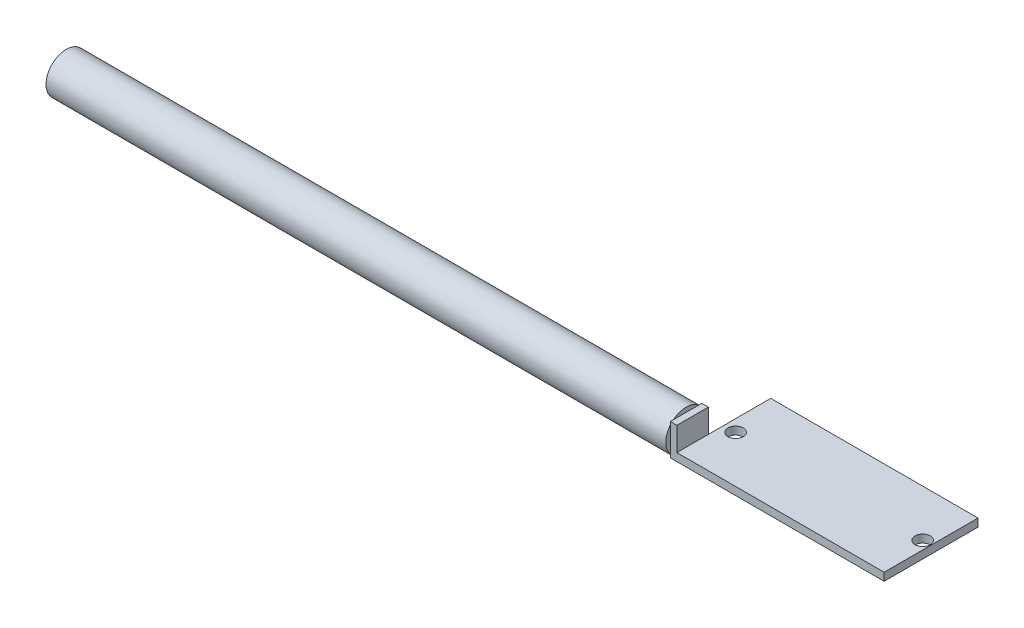
ISO-10303-21;
HEADER;
FILE_DESCRIPTION(('STEP AP214'),'2;1');
FILE_NAME('part.step','',(''),(''),'','','');
FILE_SCHEMA(('AUTOMOTIVE_DESIGN { 1 0 10303 214 1 1 1 1 }'));
ENDSEC;
DATA;
#1=APPLICATION_CONTEXT('core data for automotive mechanical design processes');
#2=APPLICATION_PROTOCOL_DEFINITION('international standard','automotive_design',2000,#1);
#3=PRODUCT_CONTEXT('',#1,'mechanical');
#4=PRODUCT('Part','Part','',(#3));
#5=PRODUCT_RELATED_PRODUCT_CATEGORY('part','',(#4));
#6=PRODUCT_DEFINITION_FORMATION('','',#4);
#7=PRODUCT_DEFINITION_CONTEXT('part definition',#1,'design');
#8=PRODUCT_DEFINITION('design','',#6,#7);
#9=PRODUCT_DEFINITION_SHAPE('','',#8);
#10=(LENGTH_UNIT() NAMED_UNIT(*) SI_UNIT(.MILLI.,.METRE.));
#11=(NAMED_UNIT(*) PLANE_ANGLE_UNIT() SI_UNIT($,.RADIAN.));
#12=(NAMED_UNIT(*) SI_UNIT($,.STERADIAN.) SOLID_ANGLE_UNIT());
#13=UNCERTAINTY_MEASURE_WITH_UNIT(LENGTH_MEASURE(1.E-05),#10,'distance_accuracy_value','');
#14=(GEOMETRIC_REPRESENTATION_CONTEXT(3) GLOBAL_UNCERTAINTY_ASSIGNED_CONTEXT((#13)) GLOBAL_UNIT_ASSIGNED_CONTEXT((#10,
#11,#12)) REPRESENTATION_CONTEXT('',''));
#15=CARTESIAN_POINT('',(0.,0.,0.));
#16=DIRECTION('',(0.,0.,1.));
#17=DIRECTION('',(1.,0.,0.));
#18=AXIS2_PLACEMENT_3D('',#15,#16,#17);
#19=CARTESIAN_POINT('',(-21.336,0.,0.));
#20=DIRECTION('',(-1.,0.,0.));
#21=DIRECTION('',(0.,0.,1.));
#22=AXIS2_PLACEMENT_3D('',#19,#20,#21);
#23=PLANE('',#22);
#24=CARTESIAN_POINT('',(-21.336,3.048,6.03885));
#25=DIRECTION('',(-1.,0.,0.));
#26=DIRECTION('',(0.,0.,1.));
#27=AXIS2_PLACEMENT_3D('',#24,#25,#26);
#28=CIRCLE('',#27,3.91795);
#29=CARTESIAN_POINT('',(-21.336,5.50971245325282,9.08685));
#30=VERTEX_POINT('',#29);
#31=CARTESIAN_POINT('',(-21.336,6.096,8.50056245325282));
#32=VERTEX_POINT('',#31);
#33=EDGE_CURVE('E154',#30,#32,#28,.T.);
#34=ORIENTED_EDGE('',*,*,#33,.F.);
#35=DIRECTION('',(0.,1.,0.));
#36=VECTOR('',#35,1.);
#37=CARTESIAN_POINT('',(-21.336,0.,9.08685));
#38=LINE('',#37,#36);
#39=CARTESIAN_POINT('',(-21.336,6.096,9.08685));
#40=VERTEX_POINT('',#39);
#41=EDGE_CURVE('E140',#30,#40,#38,.T.);
#42=ORIENTED_EDGE('',*,*,#41,.T.);
#43=DIRECTION('',(0.,0.,-1.));
#44=VECTOR('',#43,1.);
#45=CARTESIAN_POINT('',(-21.336,6.096,9.08685));
#46=LINE('',#45,#44);
#47=EDGE_CURVE('E183',#40,#32,#46,.T.);
#48=ORIENTED_EDGE('',*,*,#47,.T.);
#49=EDGE_LOOP('',(#34,#42,#48));
#50=FACE_BOUND('',#49,.T.);
#51=ADVANCED_FACE('F43',(#50),#23,.T.);
#52=CARTESIAN_POINT('',(-21.336,6.096,3.57713754674718));
#53=VERTEX_POINT('',#52);
#54=CARTESIAN_POINT('',(-21.336,5.50971245325282,2.99085));
#55=VERTEX_POINT('',#54);
#56=EDGE_CURVE('E11',#53,#55,#28,.T.);
#57=ORIENTED_EDGE('',*,*,#56,.F.);
#58=CARTESIAN_POINT('',(-21.336,6.096,2.99085));
#59=VERTEX_POINT('',#58);
#60=EDGE_CURVE('E137',#53,#59,#46,.T.);
#61=ORIENTED_EDGE('',*,*,#60,.T.);
#62=DIRECTION('',(0.,-1.,0.));
#63=VECTOR('',#62,1.);
#64=CARTESIAN_POINT('',(-21.336,0.,2.99085));
#65=LINE('',#64,#63);
#66=EDGE_CURVE('E180',#59,#55,#65,.T.);
#67=ORIENTED_EDGE('',*,*,#66,.T.);
#68=EDGE_LOOP('',(#57,#61,#67));
#69=FACE_BOUND('',#68,.T.);
#70=ADVANCED_FACE('F260',(#69),#23,.T.);
#71=CARTESIAN_POINT('',(-21.336,0.586287546747183,2.99085));
#72=VERTEX_POINT('',#71);
#73=CARTESIAN_POINT('',(-21.336,0.,3.57713754674719));
#74=VERTEX_POINT('',#73);
#75=EDGE_CURVE('E52',#72,#74,#28,.T.);
#76=ORIENTED_EDGE('',*,*,#75,.F.);
#77=CARTESIAN_POINT('',(-21.336,0.,2.99085));
#78=VERTEX_POINT('',#77);
#79=EDGE_CURVE('E181',#72,#78,#65,.T.);
#80=ORIENTED_EDGE('',*,*,#79,.T.);
#81=DIRECTION('',(0.,0.,1.));
#82=VECTOR('',#81,1.);
#83=CARTESIAN_POINT('',(-21.336,0.,9.08685));
#84=LINE('',#83,#82);
#85=EDGE_CURVE('E186',#78,#74,#84,.T.);
#86=ORIENTED_EDGE('',*,*,#85,.T.);
#87=EDGE_LOOP('',(#76,#80,#86));
#88=FACE_BOUND('',#87,.T.);
#89=ADVANCED_FACE('F277',(#88),#23,.T.);
#90=CARTESIAN_POINT('',(-20.066,1.524,9.08685));
#91=DIRECTION('',(1.,0.,0.));
#92=DIRECTION('',(0.,0.,-1.));
#93=AXIS2_PLACEMENT_3D('',#90,#91,#92);
#94=PLANE('',#93);
#95=DIRECTION('',(0.,-1.,0.));
#96=VECTOR('',#95,1.);
#97=CARTESIAN_POINT('',(-20.066,0.,2.99085));
#98=LINE('',#97,#96);
#99=CARTESIAN_POINT('',(-20.066,1.524,2.99085));
#100=VERTEX_POINT('',#99);
#101=CARTESIAN_POINT('',(-20.066,0.,2.99085));
#102=VERTEX_POINT('',#101);
#103=EDGE_CURVE('E159',#100,#102,#98,.T.);
#104=ORIENTED_EDGE('',*,*,#103,.F.);
#105=DIRECTION('',(0.,0.,1.));
#106=VECTOR('',#105,1.);
#107=CARTESIAN_POINT('',(-20.066,1.524,9.08685));
#108=LINE('',#107,#106);
#109=CARTESIAN_POINT('',(-20.066,1.524,-9.08685));
#110=VERTEX_POINT('',#109);
#111=EDGE_CURVE('E209',#110,#100,#108,.T.);
#112=ORIENTED_EDGE('',*,*,#111,.F.);
#113=DIRECTION('',(0.,-1.,0.));
#114=VECTOR('',#113,1.);
#115=CARTESIAN_POINT('',(-20.066,1.524,-9.08685));
#116=LINE('',#115,#114);
#117=CARTESIAN_POINT('',(-20.066,0.,-9.08685));
#118=VERTEX_POINT('',#117);
#119=EDGE_CURVE('E223',#110,#118,#116,.T.);
#120=ORIENTED_EDGE('',*,*,#119,.T.);
#121=DIRECTION('',(0.,0.,1.));
#122=VECTOR('',#121,1.);
#123=CARTESIAN_POINT('',(-20.066,0.,9.08685));
#124=LINE('',#123,#122);
#125=EDGE_CURVE('E219',#118,#102,#124,.T.);
#126=ORIENTED_EDGE('',*,*,#125,.T.);
#127=EDGE_LOOP('',(#104,#112,#120,#126));
#128=FACE_BOUND('',#127,.T.);
#129=ADVANCED_FACE('F239',(#128),#94,.F.);
#130=CARTESIAN_POINT('',(20.066,1.524,9.08685));
#131=DIRECTION('',(-1.,0.,0.));
#132=DIRECTION('',(0.,0.,1.));
#133=AXIS2_PLACEMENT_3D('',#130,#131,#132);
#134=PLANE('',#133);
#135=DIRECTION('',(0.,0.,-1.));
#136=VECTOR('',#135,1.);
#137=CARTESIAN_POINT('',(20.066,0.,9.08685));
#138=LINE('',#137,#136);
#139=CARTESIAN_POINT('',(20.066,0.,9.08685));
#140=VERTEX_POINT('',#139);
#141=CARTESIAN_POINT('',(20.066,0.,-9.08685));
#142=VERTEX_POINT('',#141);
#143=EDGE_CURVE('E201',#140,#142,#138,.T.);
#144=ORIENTED_EDGE('',*,*,#143,.T.);
#145=DIRECTION('',(0.,-1.,0.));
#146=VECTOR('',#145,1.);
#147=CARTESIAN_POINT('',(20.066,1.524,-9.08685));
#148=LINE('',#147,#146);
#149=CARTESIAN_POINT('',(20.066,1.524,-9.08685));
#150=VERTEX_POINT('',#149);
#151=EDGE_CURVE('E47',#150,#142,#148,.T.);
#152=ORIENTED_EDGE('',*,*,#151,.F.);
#153=DIRECTION('',(0.,0.,-1.));
#154=VECTOR('',#153,1.);
#155=CARTESIAN_POINT('',(20.066,1.524,9.08685));
#156=LINE('',#155,#154);
#157=CARTESIAN_POINT('',(20.066,1.524,9.08685));
#158=VERTEX_POINT('',#157);
#159=EDGE_CURVE('E202',#158,#150,#156,.T.);
#160=ORIENTED_EDGE('',*,*,#159,.F.);
#161=DIRECTION('',(0.,-1.,0.));
#162=VECTOR('',#161,1.);
#163=CARTESIAN_POINT('',(20.066,1.524,9.08685));
#164=LINE('',#163,#162);
#165=EDGE_CURVE('E214',#158,#140,#164,.T.);
#166=ORIENTED_EDGE('',*,*,#165,.T.);
#167=EDGE_LOOP('',(#144,#152,#160,#166));
#168=FACE_BOUND('',#167,.T.);
#169=ADVANCED_FACE('F45',(#168),#134,.F.);
#170=CARTESIAN_POINT('',(-20.066,1.524,-9.08685));
#171=DIRECTION('',(0.,0.,1.));
#172=DIRECTION('',(1.,0.,0.));
#173=AXIS2_PLACEMENT_3D('',#170,#171,#172);
#174=PLANE('',#173);
#175=DIRECTION('',(-1.,0.,0.));
#176=VECTOR('',#175,1.);
#177=CARTESIAN_POINT('',(-20.066,0.,-9.08685));
#178=LINE('',#177,#176);
#179=EDGE_CURVE('E217',#142,#118,#178,.T.);
#180=ORIENTED_EDGE('',*,*,#179,.T.);
#181=ORIENTED_EDGE('',*,*,#119,.F.);
#182=DIRECTION('',(-1.,0.,0.));
#183=VECTOR('',#182,1.);
#184=CARTESIAN_POINT('',(-20.066,1.524,-9.08685));
#185=LINE('',#184,#183);
#186=EDGE_CURVE('E205',#150,#110,#185,.T.);
#187=ORIENTED_EDGE('',*,*,#186,.F.);
#188=ORIENTED_EDGE('',*,*,#151,.T.);
#189=EDGE_LOOP('',(#180,#181,#187,#188));
#190=FACE_BOUND('',#189,.T.);
#191=ADVANCED_FACE('F232',(#190),#174,.F.);
#192=CARTESIAN_POINT('',(-20.066,1.524,9.08685));
#193=DIRECTION('',(0.,0.,-1.));
#194=DIRECTION('',(-1.,0.,0.));
#195=AXIS2_PLACEMENT_3D('',#192,#193,#194);
#196=PLANE('',#195);
#197=DIRECTION('',(1.,0.,0.));
#198=VECTOR('',#197,1.);
#199=CARTESIAN_POINT('',(-20.066,0.,9.08685));
#200=LINE('',#199,#198);
#201=CARTESIAN_POINT('',(-21.336,0.,9.08685));
#202=VERTEX_POINT('',#201);
#203=EDGE_CURVE('E206',#202,#140,#200,.T.);
#204=ORIENTED_EDGE('',*,*,#203,.T.);
#205=ORIENTED_EDGE('',*,*,#165,.F.);
#206=DIRECTION('',(1.,0.,0.));
#207=VECTOR('',#206,1.);
#208=CARTESIAN_POINT('',(-20.066,1.524,9.08685));
#209=LINE('',#208,#207);
#210=CARTESIAN_POINT('',(-20.066,1.524,9.08685));
#211=VERTEX_POINT('',#210);
#212=EDGE_CURVE('E212',#211,#158,#209,.T.);
#213=ORIENTED_EDGE('',*,*,#212,.F.);
#214=DIRECTION('',(0.,1.,0.));
#215=VECTOR('',#214,1.);
#216=CARTESIAN_POINT('',(-20.066,0.,9.08685));
#217=LINE('',#216,#215);
#218=CARTESIAN_POINT('',(-20.066,6.096,9.08685));
#219=VERTEX_POINT('',#218);
#220=EDGE_CURVE('E167',#211,#219,#217,.T.);
#221=ORIENTED_EDGE('',*,*,#220,.T.);
#222=DIRECTION('',(1.,0.,0.));
#223=VECTOR('',#222,1.);
#224=CARTESIAN_POINT('',(-21.336,6.096,9.08685));
#225=LINE('',#224,#223);
#226=EDGE_CURVE('E198',#40,#219,#225,.T.);
#227=ORIENTED_EDGE('',*,*,#226,.F.);
#228=ORIENTED_EDGE('',*,*,#41,.F.);
#229=CARTESIAN_POINT('',(-21.336,0.586287546747183,9.08685));
#230=VERTEX_POINT('',#229);
#231=EDGE_CURVE('E138',#230,#30,#38,.T.);
#232=ORIENTED_EDGE('',*,*,#231,.F.);
#233=EDGE_CURVE('E131',#202,#230,#38,.T.);
#234=ORIENTED_EDGE('',*,*,#233,.F.);
#235=EDGE_LOOP('',(#204,#205,#213,#221,#227,#228,#232,#234));
#236=FACE_BOUND('',#235,.T.);
#237=ADVANCED_FACE('F144',(#236),#196,.F.);
#238=CARTESIAN_POINT('',(0.,1.524,0.));
#239=DIRECTION('',(0.,-1.,0.));
#240=DIRECTION('',(0.,0.,-1.));
#241=AXIS2_PLACEMENT_3D('',#238,#239,#240);
#242=PLANE('',#241);
#243=CARTESIAN_POINT('',(-17.776825,1.524,0.));
#244=DIRECTION('',(0.,1.,0.));
#245=DIRECTION('',(0.,0.,1.));
#246=AXIS2_PLACEMENT_3D('',#243,#244,#245);
#247=CIRCLE('',#246,1.476375);
#248=CARTESIAN_POINT('',(-17.776825,1.524,1.476375));
#249=VERTEX_POINT('',#248);
#250=EDGE_CURVE('E318',#249,#249,#247,.T.);
#251=ORIENTED_EDGE('',*,*,#250,.F.);
#252=EDGE_LOOP('',(#251));
#253=FACE_BOUND('',#252,.T.);
#254=CARTESIAN_POINT('',(18.437225,1.524,0.));
#255=DIRECTION('',(0.,1.,0.));
#256=DIRECTION('',(0.,0.,1.));
#257=AXIS2_PLACEMENT_3D('',#254,#255,#256);
#258=CIRCLE('',#257,1.476375);
#259=CARTESIAN_POINT('',(18.437225,1.524,1.47637499999999));
#260=VERTEX_POINT('',#259);
#261=EDGE_CURVE('E326',#260,#260,#258,.T.);
#262=ORIENTED_EDGE('',*,*,#261,.F.);
#263=EDGE_LOOP('',(#262));
#264=FACE_BOUND('',#263,.T.);
#265=ORIENTED_EDGE('',*,*,#159,.T.);
#266=ORIENTED_EDGE('',*,*,#186,.T.);
#267=ORIENTED_EDGE('',*,*,#111,.T.);
#268=EDGE_CURVE('E208',#100,#211,#108,.T.);
#269=ORIENTED_EDGE('',*,*,#268,.T.);
#270=ORIENTED_EDGE('',*,*,#212,.T.);
#271=EDGE_LOOP('',(#265,#266,#267,#269,#270));
#272=FACE_BOUND('',#271,.T.);
#273=ADVANCED_FACE('F250',(#253,#264,#272),#242,.F.);
#274=CARTESIAN_POINT('',(0.,0.,0.));
#275=DIRECTION('',(0.,-1.,0.));
#276=DIRECTION('',(0.,0.,-1.));
#277=AXIS2_PLACEMENT_3D('',#274,#275,#276);
#278=PLANE('',#277);
#279=CARTESIAN_POINT('',(-17.776825,0.,0.));
#280=DIRECTION('',(0.,-1.,0.));
#281=DIRECTION('',(0.,0.,-1.));
#282=AXIS2_PLACEMENT_3D('',#279,#280,#281);
#283=CIRCLE('',#282,1.476375);
#284=CARTESIAN_POINT('',(-17.776825,0.,-1.476375));
#285=VERTEX_POINT('',#284);
#286=EDGE_CURVE('E153',#285,#285,#283,.F.);
#287=ORIENTED_EDGE('',*,*,#286,.T.);
#288=EDGE_LOOP('',(#287));
#289=FACE_BOUND('',#288,.T.);
#290=CARTESIAN_POINT('',(18.437225,0.,0.));
#291=DIRECTION('',(0.,-1.,0.));
#292=DIRECTION('',(0.,0.,-1.));
#293=AXIS2_PLACEMENT_3D('',#290,#291,#292);
#294=CIRCLE('',#293,1.476375);
#295=CARTESIAN_POINT('',(18.437225,0.,-1.476375));
#296=VERTEX_POINT('',#295);
#297=EDGE_CURVE('E323',#296,#296,#294,.F.);
#298=ORIENTED_EDGE('',*,*,#297,.T.);
#299=EDGE_LOOP('',(#298));
#300=FACE_BOUND('',#299,.T.);
#301=ORIENTED_EDGE('',*,*,#143,.F.);
#302=ORIENTED_EDGE('',*,*,#203,.F.);
#303=CARTESIAN_POINT('',(-21.336,0.,8.50056245325282));
#304=VERTEX_POINT('',#303);
#305=EDGE_CURVE('E134',#304,#202,#84,.T.);
#306=ORIENTED_EDGE('',*,*,#305,.F.);
#307=EDGE_CURVE('E68',#74,#304,#84,.T.);
#308=ORIENTED_EDGE('',*,*,#307,.F.);
#309=ORIENTED_EDGE('',*,*,#85,.F.);
#310=DIRECTION('',(1.,0.,0.));
#311=VECTOR('',#310,1.);
#312=CARTESIAN_POINT('',(-21.336,0.,2.99085));
#313=LINE('',#312,#311);
#314=EDGE_CURVE('E188',#78,#102,#313,.T.);
#315=ORIENTED_EDGE('',*,*,#314,.T.);
#316=ORIENTED_EDGE('',*,*,#125,.F.);
#317=ORIENTED_EDGE('',*,*,#179,.F.);
#318=EDGE_LOOP('',(#301,#302,#306,#308,#309,#315,#316,#317));
#319=FACE_BOUND('',#318,.T.);
#320=ADVANCED_FACE('F237',(#289,#300,#319),#278,.T.);
#321=CARTESIAN_POINT('',(-21.336,6.096,9.08685));
#322=DIRECTION('',(0.,-1.,0.));
#323=DIRECTION('',(0.,0.,-1.));
#324=AXIS2_PLACEMENT_3D('',#321,#322,#323);
#325=PLANE('',#324);
#326=DIRECTION('',(0.,0.,-1.));
#327=VECTOR('',#326,1.);
#328=CARTESIAN_POINT('',(-20.066,6.096,9.08685));
#329=LINE('',#328,#327);
#330=CARTESIAN_POINT('',(-20.066,6.096,2.99085));
#331=VERTEX_POINT('',#330);
#332=EDGE_CURVE('E190',#219,#331,#329,.T.);
#333=ORIENTED_EDGE('',*,*,#332,.T.);
#334=DIRECTION('',(1.,0.,0.));
#335=VECTOR('',#334,1.);
#336=CARTESIAN_POINT('',(-21.336,6.096,2.99085));
#337=LINE('',#336,#335);
#338=EDGE_CURVE('E195',#59,#331,#337,.T.);
#339=ORIENTED_EDGE('',*,*,#338,.F.);
#340=ORIENTED_EDGE('',*,*,#60,.F.);
#341=EDGE_CURVE('E257',#32,#53,#46,.T.);
#342=ORIENTED_EDGE('',*,*,#341,.F.);
#343=ORIENTED_EDGE('',*,*,#47,.F.);
#344=ORIENTED_EDGE('',*,*,#226,.T.);
#345=EDGE_LOOP('',(#333,#339,#340,#342,#343,#344));
#346=FACE_BOUND('',#345,.T.);
#347=ADVANCED_FACE('F253',(#346),#325,.F.);
#348=CARTESIAN_POINT('',(-21.336,0.,2.99085));
#349=DIRECTION('',(0.,0.,1.));
#350=DIRECTION('',(1.,0.,0.));
#351=AXIS2_PLACEMENT_3D('',#348,#349,#350);
#352=PLANE('',#351);
#353=EDGE_CURVE('E162',#331,#100,#98,.T.);
#354=ORIENTED_EDGE('',*,*,#353,.T.);
#355=ORIENTED_EDGE('',*,*,#103,.T.);
#356=ORIENTED_EDGE('',*,*,#314,.F.);
#357=ORIENTED_EDGE('',*,*,#79,.F.);
#358=EDGE_CURVE('E175',#55,#72,#65,.T.);
#359=ORIENTED_EDGE('',*,*,#358,.F.);
#360=ORIENTED_EDGE('',*,*,#66,.F.);
#361=ORIENTED_EDGE('',*,*,#338,.T.);
#362=EDGE_LOOP('',(#354,#355,#356,#357,#359,#360,#361));
#363=FACE_BOUND('',#362,.T.);
#364=ADVANCED_FACE('F240',(#363),#352,.F.);
#365=EDGE_CURVE('E61',#304,#230,#28,.T.);
#366=ORIENTED_EDGE('',*,*,#365,.F.);
#367=ORIENTED_EDGE('',*,*,#305,.T.);
#368=ORIENTED_EDGE('',*,*,#233,.T.);
#369=EDGE_LOOP('',(#366,#367,#368));
#370=FACE_BOUND('',#369,.T.);
#371=ADVANCED_FACE('F133',(#370),#23,.T.);
#372=CARTESIAN_POINT('',(-20.066,0.,0.));
#373=DIRECTION('',(-1.,0.,0.));
#374=DIRECTION('',(0.,0.,1.));
#375=AXIS2_PLACEMENT_3D('',#372,#373,#374);
#376=PLANE('',#375);
#377=ORIENTED_EDGE('',*,*,#268,.F.);
#378=ORIENTED_EDGE('',*,*,#353,.F.);
#379=ORIENTED_EDGE('',*,*,#332,.F.);
#380=ORIENTED_EDGE('',*,*,#220,.F.);
#381=EDGE_LOOP('',(#377,#378,#379,#380));
#382=FACE_BOUND('',#381,.T.);
#383=ADVANCED_FACE('F246',(#382),#376,.F.);
#384=CARTESIAN_POINT('',(-21.336,3.048,6.03885));
#385=DIRECTION('',(-1.,0.,0.));
#386=DIRECTION('',(0.,0.,1.));
#387=AXIS2_PLACEMENT_3D('',#384,#385,#386);
#388=PLANE('',#387);
#389=EDGE_CURVE('E148',#230,#30,#28,.T.);
#390=ORIENTED_EDGE('',*,*,#389,.F.);
#391=ORIENTED_EDGE('',*,*,#231,.T.);
#392=EDGE_LOOP('',(#390,#391));
#393=FACE_BOUND('',#392,.T.);
#394=ADVANCED_FACE('F149',(#393),#388,.F.);
#395=EDGE_CURVE('E54',#32,#53,#28,.T.);
#396=ORIENTED_EDGE('',*,*,#395,.F.);
#397=ORIENTED_EDGE('',*,*,#341,.T.);
#398=EDGE_LOOP('',(#396,#397));
#399=FACE_BOUND('',#398,.T.);
#400=ADVANCED_FACE('F262',(#399),#388,.F.);
#401=EDGE_CURVE('E168',#55,#72,#28,.T.);
#402=ORIENTED_EDGE('',*,*,#401,.F.);
#403=ORIENTED_EDGE('',*,*,#358,.T.);
#404=EDGE_LOOP('',(#402,#403));
#405=FACE_BOUND('',#404,.T.);
#406=ADVANCED_FACE('F174',(#405),#388,.F.);
#407=EDGE_CURVE('E152',#74,#304,#28,.T.);
#408=ORIENTED_EDGE('',*,*,#407,.F.);
#409=ORIENTED_EDGE('',*,*,#307,.T.);
#410=EDGE_LOOP('',(#408,#409));
#411=FACE_BOUND('',#410,.T.);
#412=ADVANCED_FACE('F269',(#411),#388,.F.);
#413=CARTESIAN_POINT('',(-141.336,3.048,6.03885));
#414=DIRECTION('',(1.,0.,0.));
#415=DIRECTION('',(0.,0.,-1.));
#416=AXIS2_PLACEMENT_3D('',#413,#414,#415);
#417=CYLINDRICAL_SURFACE('',#416,3.91795);
#418=CARTESIAN_POINT('',(-141.336,3.048,6.03885));
#419=DIRECTION('',(-1.,0.,0.));
#420=DIRECTION('',(0.,0.,1.));
#421=AXIS2_PLACEMENT_3D('',#418,#419,#420);
#422=CIRCLE('',#421,3.91795);
#423=CARTESIAN_POINT('',(-141.336,3.048,9.9568));
#424=VERTEX_POINT('',#423);
#425=EDGE_CURVE('E164',#424,#424,#422,.T.);
#426=ORIENTED_EDGE('',*,*,#425,.F.);
#427=EDGE_LOOP('',(#426));
#428=FACE_BOUND('',#427,.T.);
#429=ORIENTED_EDGE('',*,*,#33,.T.);
#430=ORIENTED_EDGE('',*,*,#395,.T.);
#431=ORIENTED_EDGE('',*,*,#56,.T.);
#432=ORIENTED_EDGE('',*,*,#401,.T.);
#433=ORIENTED_EDGE('',*,*,#75,.T.);
#434=ORIENTED_EDGE('',*,*,#407,.T.);
#435=ORIENTED_EDGE('',*,*,#365,.T.);
#436=ORIENTED_EDGE('',*,*,#389,.T.);
#437=EDGE_LOOP('',(#429,#430,#431,#432,#433,#434,#435,#436));
#438=FACE_BOUND('',#437,.T.);
#439=ADVANCED_FACE('F156',(#428,#438),#417,.T.);
#440=CARTESIAN_POINT('',(-141.336,3.048,6.03885));
#441=DIRECTION('',(-1.,0.,0.));
#442=DIRECTION('',(0.,0.,1.));
#443=AXIS2_PLACEMENT_3D('',#440,#441,#442);
#444=PLANE('',#443);
#445=ORIENTED_EDGE('',*,*,#425,.T.);
#446=EDGE_LOOP('',(#445));
#447=FACE_BOUND('',#446,.T.);
#448=ADVANCED_FACE('F296',(#447),#444,.T.);
#449=CARTESIAN_POINT('',(18.437225,-4.17581909629715,0.));
#450=DIRECTION('',(0.,1.,0.));
#451=DIRECTION('',(0.,0.,1.));
#452=AXIS2_PLACEMENT_3D('',#449,#450,#451);
#453=CYLINDRICAL_SURFACE('',#452,1.476375);
#454=ORIENTED_EDGE('',*,*,#261,.T.);
#455=EDGE_LOOP('',(#454));
#456=FACE_BOUND('',#455,.T.);
#457=ORIENTED_EDGE('',*,*,#297,.F.);
#458=EDGE_LOOP('',(#457));
#459=FACE_BOUND('',#458,.T.);
#460=ADVANCED_FACE('F301',(#456,#459),#453,.F.);
#461=CARTESIAN_POINT('',(-17.776825,-4.17581909629715,0.));
#462=DIRECTION('',(0.,1.,0.));
#463=DIRECTION('',(0.,0.,1.));
#464=AXIS2_PLACEMENT_3D('',#461,#462,#463);
#465=CYLINDRICAL_SURFACE('',#464,1.476375);
#466=ORIENTED_EDGE('',*,*,#250,.T.);
#467=EDGE_LOOP('',(#466));
#468=FACE_BOUND('',#467,.T.);
#469=ORIENTED_EDGE('',*,*,#286,.F.);
#470=EDGE_LOOP('',(#469));
#471=FACE_BOUND('',#470,.T.);
#472=ADVANCED_FACE('F307',(#468,#471),#465,.F.);
#473=CLOSED_SHELL('',(#51,#70,#89,#129,#169,#191,#237,#273,#320,#347,#364,#371,#383,#394,#400,
#406,#412,#439,#448,#460,#472));
#474=MANIFOLD_SOLID_BREP('B2',#473);
#475=ADVANCED_BREP_SHAPE_REPRESENTATION('',(#18,#474),#14);
#476=SHAPE_DEFINITION_REPRESENTATION(#9,#475);
ENDSEC;
END-ISO-10303-21;
